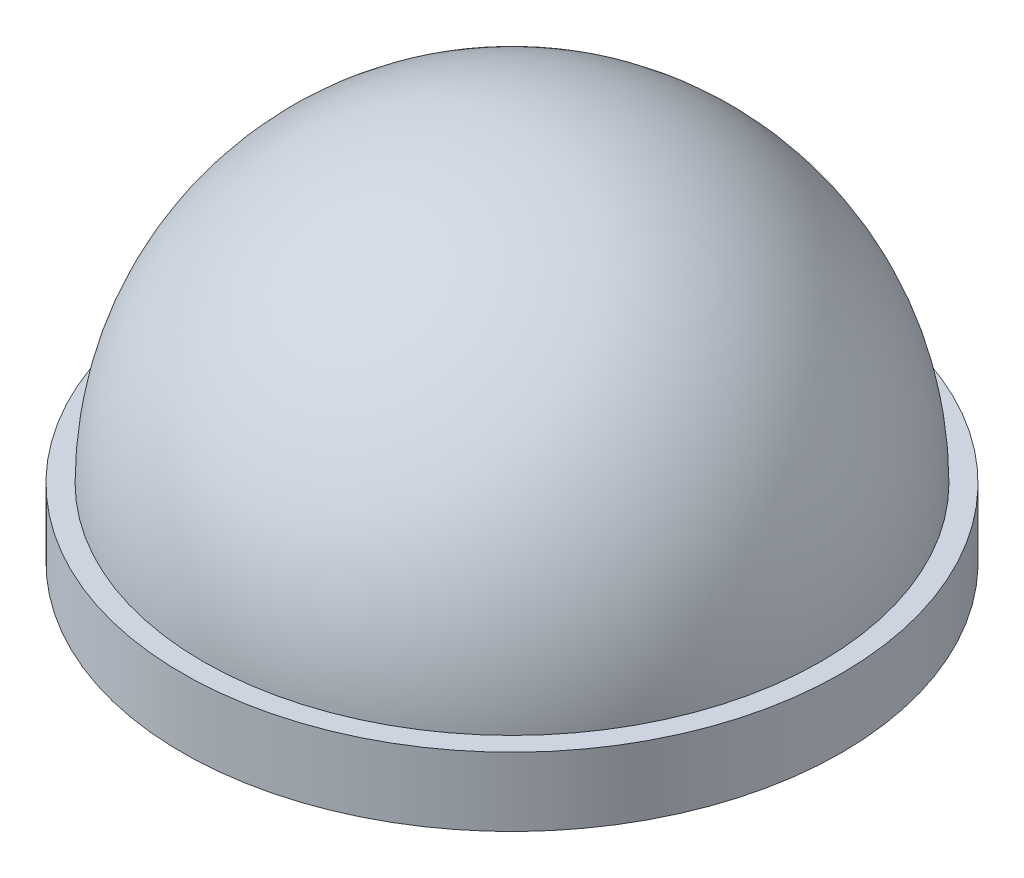
ISO-10303-21;
HEADER;
FILE_DESCRIPTION(('STEP AP214'),'2;1');
FILE_NAME('part.step','',(''),(''),'','','');
FILE_SCHEMA(('AUTOMOTIVE_DESIGN { 1 0 10303 214 1 1 1 1 }'));
ENDSEC;
DATA;
#1=APPLICATION_CONTEXT('core data for automotive mechanical design processes');
#2=APPLICATION_PROTOCOL_DEFINITION('international standard','automotive_design',2000,#1);
#3=PRODUCT_CONTEXT('',#1,'mechanical');
#4=PRODUCT('Part','Part','',(#3));
#5=PRODUCT_RELATED_PRODUCT_CATEGORY('part','',(#4));
#6=PRODUCT_DEFINITION_FORMATION('','',#4);
#7=PRODUCT_DEFINITION_CONTEXT('part definition',#1,'design');
#8=PRODUCT_DEFINITION('design','',#6,#7);
#9=PRODUCT_DEFINITION_SHAPE('','',#8);
#10=(LENGTH_UNIT() NAMED_UNIT(*) SI_UNIT(.MILLI.,.METRE.));
#11=(NAMED_UNIT(*) PLANE_ANGLE_UNIT() SI_UNIT($,.RADIAN.));
#12=(NAMED_UNIT(*) SI_UNIT($,.STERADIAN.) SOLID_ANGLE_UNIT());
#13=UNCERTAINTY_MEASURE_WITH_UNIT(LENGTH_MEASURE(1.E-05),#10,'distance_accuracy_value','');
#14=(GEOMETRIC_REPRESENTATION_CONTEXT(3) GLOBAL_UNCERTAINTY_ASSIGNED_CONTEXT((#13)) GLOBAL_UNIT_ASSIGNED_CONTEXT((#10,
#11,#12)) REPRESENTATION_CONTEXT('',''));
#15=CARTESIAN_POINT('',(0.,0.,0.));
#16=DIRECTION('',(0.,0.,1.));
#17=DIRECTION('',(1.,0.,0.));
#18=AXIS2_PLACEMENT_3D('',#15,#16,#17);
#19=CARTESIAN_POINT('',(0.,1.,0.));
#20=DIRECTION('',(0.,1.,0.));
#21=DIRECTION('',(1.,0.,0.));
#22=AXIS2_PLACEMENT_3D('',#19,#20,#21);
#23=SPHERICAL_SURFACE('',#22,4.49999999999998);
#24=CARTESIAN_POINT('',(0.,1.,0.));
#25=DIRECTION('',(0.,1.,0.));
#26=DIRECTION('',(-1.,0.,0.));
#27=AXIS2_PLACEMENT_3D('',#24,#25,#26);
#28=CIRCLE('',#27,4.49999999999999);
#29=CARTESIAN_POINT('',(-4.49999999999999,1.,0.));
#30=VERTEX_POINT('',#29);
#31=EDGE_CURVE('E10',#30,#30,#28,.T.);
#32=ORIENTED_EDGE('',*,*,#31,.T.);
#33=EDGE_LOOP('',(#32));
#34=FACE_BOUND('',#33,.T.);
#35=ADVANCED_FACE('F32',(#34),#23,.T.);
#36=CARTESIAN_POINT('',(-4.79999999999998,1.,0.));
#37=DIRECTION('',(0.,1.,0.));
#38=DIRECTION('',(-1.,0.,0.));
#39=AXIS2_PLACEMENT_3D('',#36,#37,#38);
#40=PLANE('',#39);
#41=CARTESIAN_POINT('',(0.,1.,0.));
#42=DIRECTION('',(0.,1.,0.));
#43=DIRECTION('',(-1.,0.,0.));
#44=AXIS2_PLACEMENT_3D('',#41,#42,#43);
#45=CIRCLE('',#44,4.79999999999999);
#46=CARTESIAN_POINT('',(-4.79999999999999,1.,0.));
#47=VERTEX_POINT('',#46);
#48=EDGE_CURVE('E38',#47,#47,#45,.T.);
#49=ORIENTED_EDGE('',*,*,#48,.T.);
#50=EDGE_LOOP('',(#49));
#51=FACE_BOUND('',#50,.T.);
#52=ORIENTED_EDGE('',*,*,#31,.F.);
#53=EDGE_LOOP('',(#52));
#54=FACE_BOUND('',#53,.T.);
#55=ADVANCED_FACE('F58',(#51,#54),#40,.T.);
#56=CARTESIAN_POINT('',(0.,5.49999999999998,0.));
#57=DIRECTION('',(0.,1.,0.));
#58=DIRECTION('',(-1.,0.,0.));
#59=AXIS2_PLACEMENT_3D('',#56,#57,#58);
#60=CYLINDRICAL_SURFACE('',#59,4.79999999999999);
#61=CARTESIAN_POINT('',(0.,0.,0.));
#62=DIRECTION('',(0.,1.,0.));
#63=DIRECTION('',(-1.,0.,0.));
#64=AXIS2_PLACEMENT_3D('',#61,#62,#63);
#65=CIRCLE('',#64,4.79999999999999);
#66=CARTESIAN_POINT('',(-4.79999999999999,0.,0.));
#67=VERTEX_POINT('',#66);
#68=EDGE_CURVE('E42',#67,#67,#65,.T.);
#69=ORIENTED_EDGE('',*,*,#68,.T.);
#70=EDGE_LOOP('',(#69));
#71=FACE_BOUND('',#70,.T.);
#72=ORIENTED_EDGE('',*,*,#48,.F.);
#73=EDGE_LOOP('',(#72));
#74=FACE_BOUND('',#73,.T.);
#75=ADVANCED_FACE('F49',(#71,#74),#60,.T.);
#76=CARTESIAN_POINT('',(0.,0.,0.));
#77=DIRECTION('',(0.,-1.,0.));
#78=DIRECTION('',(1.,0.,0.));
#79=AXIS2_PLACEMENT_3D('',#76,#77,#78);
#80=PLANE('',#79);
#81=ORIENTED_EDGE('',*,*,#68,.F.);
#82=EDGE_LOOP('',(#81));
#83=FACE_BOUND('',#82,.T.);
#84=ADVANCED_FACE('F52',(#83),#80,.T.);
#85=CLOSED_SHELL('',(#35,#55,#75,#84));
#86=MANIFOLD_SOLID_BREP('B2',#85);
#87=ADVANCED_BREP_SHAPE_REPRESENTATION('',(#18,#86),#14);
#88=SHAPE_DEFINITION_REPRESENTATION(#9,#87);
ENDSEC;
END-ISO-10303-21;
